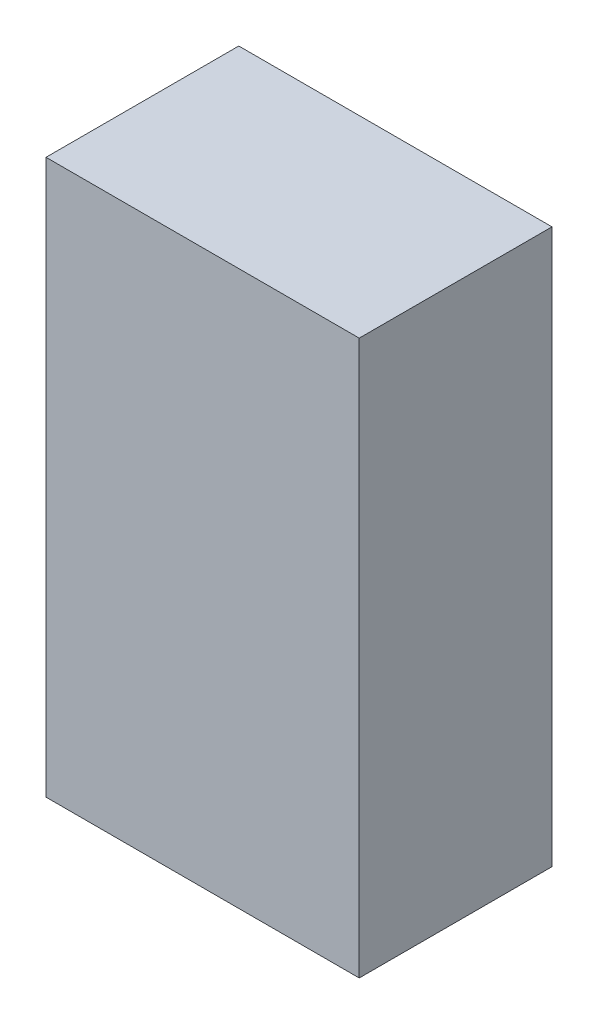
ISO-10303-21;
HEADER;
FILE_DESCRIPTION(('STEP AP214'),'2;1');
FILE_NAME('part.step','',(''),(''),'','','');
FILE_SCHEMA(('AUTOMOTIVE_DESIGN { 1 0 10303 214 1 1 1 1 }'));
ENDSEC;
DATA;
#1=APPLICATION_CONTEXT('core data for automotive mechanical design processes');
#2=APPLICATION_PROTOCOL_DEFINITION('international standard','automotive_design',2000,#1);
#3=PRODUCT_CONTEXT('',#1,'mechanical');
#4=PRODUCT('Part','Part','',(#3));
#5=PRODUCT_RELATED_PRODUCT_CATEGORY('part','',(#4));
#6=PRODUCT_DEFINITION_FORMATION('','',#4);
#7=PRODUCT_DEFINITION_CONTEXT('part definition',#1,'design');
#8=PRODUCT_DEFINITION('design','',#6,#7);
#9=PRODUCT_DEFINITION_SHAPE('','',#8);
#10=(LENGTH_UNIT() NAMED_UNIT(*) SI_UNIT(.MILLI.,.METRE.));
#11=(NAMED_UNIT(*) PLANE_ANGLE_UNIT() SI_UNIT($,.RADIAN.));
#12=(NAMED_UNIT(*) SI_UNIT($,.STERADIAN.) SOLID_ANGLE_UNIT());
#13=UNCERTAINTY_MEASURE_WITH_UNIT(LENGTH_MEASURE(1.E-05),#10,'distance_accuracy_value','');
#14=(GEOMETRIC_REPRESENTATION_CONTEXT(3) GLOBAL_UNCERTAINTY_ASSIGNED_CONTEXT((#13)) GLOBAL_UNIT_ASSIGNED_CONTEXT((#10,
#11,#12)) REPRESENTATION_CONTEXT('',''));
#15=CARTESIAN_POINT('',(0.,0.,0.));
#16=DIRECTION('',(0.,0.,1.));
#17=DIRECTION('',(1.,0.,0.));
#18=AXIS2_PLACEMENT_3D('',#15,#16,#17);
#19=CARTESIAN_POINT('',(1.29999994,-2.30000048,1.59999934));
#20=DIRECTION('',(0.,0.,-1.));
#21=DIRECTION('',(-1.,0.,0.));
#22=AXIS2_PLACEMENT_3D('',#19,#20,#21);
#23=PLANE('',#22);
#24=DIRECTION('',(1.,0.,0.));
#25=VECTOR('',#24,1.);
#26=CARTESIAN_POINT('',(1.29999994,2.30000048,1.59999934));
#27=LINE('',#26,#25);
#28=CARTESIAN_POINT('',(1.29999994,2.30000048,1.59999934));
#29=VERTEX_POINT('',#28);
#30=CARTESIAN_POINT('',(-1.29999994,2.30000048,1.59999934));
#31=VERTEX_POINT('',#30);
#32=EDGE_CURVE('E55',#29,#31,#27,.F.);
#33=ORIENTED_EDGE('',*,*,#32,.T.);
#34=DIRECTION('',(0.,1.,0.));
#35=VECTOR('',#34,1.);
#36=CARTESIAN_POINT('',(-1.29999994,2.30000048,1.59999934));
#37=LINE('',#36,#35);
#38=CARTESIAN_POINT('',(-1.29999994,-2.30000048,1.59999934));
#39=VERTEX_POINT('',#38);
#40=EDGE_CURVE('E57',#31,#39,#37,.F.);
#41=ORIENTED_EDGE('',*,*,#40,.T.);
#42=DIRECTION('',(1.,0.,0.));
#43=VECTOR('',#42,1.);
#44=CARTESIAN_POINT('',(-1.29999994,-2.30000048,1.59999934));
#45=LINE('',#44,#43);
#46=CARTESIAN_POINT('',(1.29999994,-2.30000048,1.59999934));
#47=VERTEX_POINT('',#46);
#48=EDGE_CURVE('E20',#39,#47,#45,.T.);
#49=ORIENTED_EDGE('',*,*,#48,.T.);
#50=DIRECTION('',(0.,1.,0.));
#51=VECTOR('',#50,1.);
#52=CARTESIAN_POINT('',(1.29999994,-2.30000048,1.59999934));
#53=LINE('',#52,#51);
#54=EDGE_CURVE('E80',#47,#29,#53,.T.);
#55=ORIENTED_EDGE('',*,*,#54,.T.);
#56=EDGE_LOOP('',(#33,#41,#49,#55));
#57=FACE_BOUND('',#56,.T.);
#58=ADVANCED_FACE('F17',(#57),#23,.F.);
#59=CARTESIAN_POINT('',(-1.29999994,-2.30000048,0.));
#60=DIRECTION('',(0.,1.,0.));
#61=DIRECTION('',(0.,0.,1.));
#62=AXIS2_PLACEMENT_3D('',#59,#60,#61);
#63=PLANE('',#62);
#64=DIRECTION('',(0.,0.,1.));
#65=VECTOR('',#64,1.);
#66=CARTESIAN_POINT('',(1.29999994,-2.30000048,0.));
#67=LINE('',#66,#65);
#68=CARTESIAN_POINT('',(1.29999994,-2.30000048,0.));
#69=VERTEX_POINT('',#68);
#70=EDGE_CURVE('E68',#69,#47,#67,.T.);
#71=ORIENTED_EDGE('',*,*,#70,.T.);
#72=ORIENTED_EDGE('',*,*,#48,.F.);
#73=DIRECTION('',(0.,0.,-1.));
#74=VECTOR('',#73,1.);
#75=CARTESIAN_POINT('',(-1.29999994,-2.30000048,0.));
#76=LINE('',#75,#74);
#77=CARTESIAN_POINT('',(-1.29999994,-2.30000048,0.));
#78=VERTEX_POINT('',#77);
#79=EDGE_CURVE('E63',#39,#78,#76,.T.);
#80=ORIENTED_EDGE('',*,*,#79,.T.);
#81=DIRECTION('',(-1.,0.,0.));
#82=VECTOR('',#81,1.);
#83=CARTESIAN_POINT('',(1.29999994,-2.30000048,0.));
#84=LINE('',#83,#82);
#85=EDGE_CURVE('E83',#69,#78,#84,.T.);
#86=ORIENTED_EDGE('',*,*,#85,.F.);
#87=EDGE_LOOP('',(#71,#72,#80,#86));
#88=FACE_BOUND('',#87,.T.);
#89=ADVANCED_FACE('F65',(#88),#63,.F.);
#90=CARTESIAN_POINT('',(-1.29999994,2.30000048,0.));
#91=DIRECTION('',(1.,0.,0.));
#92=DIRECTION('',(0.,0.,-1.));
#93=AXIS2_PLACEMENT_3D('',#90,#91,#92);
#94=PLANE('',#93);
#95=ORIENTED_EDGE('',*,*,#79,.F.);
#96=ORIENTED_EDGE('',*,*,#40,.F.);
#97=DIRECTION('',(0.,0.,-1.));
#98=VECTOR('',#97,1.);
#99=CARTESIAN_POINT('',(-1.29999994,2.30000048,0.));
#100=LINE('',#99,#98);
#101=CARTESIAN_POINT('',(-1.29999994,2.30000048,0.));
#102=VERTEX_POINT('',#101);
#103=EDGE_CURVE('E75',#31,#102,#100,.T.);
#104=ORIENTED_EDGE('',*,*,#103,.T.);
#105=DIRECTION('',(0.,1.,0.));
#106=VECTOR('',#105,1.);
#107=CARTESIAN_POINT('',(-1.29999994,-2.30000048,0.));
#108=LINE('',#107,#106);
#109=EDGE_CURVE('E72',#78,#102,#108,.T.);
#110=ORIENTED_EDGE('',*,*,#109,.F.);
#111=EDGE_LOOP('',(#95,#96,#104,#110));
#112=FACE_BOUND('',#111,.T.);
#113=ADVANCED_FACE('F70',(#112),#94,.F.);
#114=CARTESIAN_POINT('',(1.29999994,2.30000048,0.));
#115=DIRECTION('',(0.,-1.,0.));
#116=DIRECTION('',(0.,0.,-1.));
#117=AXIS2_PLACEMENT_3D('',#114,#115,#116);
#118=PLANE('',#117);
#119=ORIENTED_EDGE('',*,*,#103,.F.);
#120=ORIENTED_EDGE('',*,*,#32,.F.);
#121=DIRECTION('',(0.,0.,1.));
#122=VECTOR('',#121,1.);
#123=CARTESIAN_POINT('',(1.29999994,2.30000048,0.));
#124=LINE('',#123,#122);
#125=CARTESIAN_POINT('',(1.29999994,2.30000048,0.));
#126=VERTEX_POINT('',#125);
#127=EDGE_CURVE('E35',#29,#126,#124,.F.);
#128=ORIENTED_EDGE('',*,*,#127,.T.);
#129=DIRECTION('',(-1.,0.,0.));
#130=VECTOR('',#129,1.);
#131=CARTESIAN_POINT('',(1.29999994,2.30000048,0.));
#132=LINE('',#131,#130);
#133=EDGE_CURVE('E26',#102,#126,#132,.F.);
#134=ORIENTED_EDGE('',*,*,#133,.F.);
#135=EDGE_LOOP('',(#119,#120,#128,#134));
#136=FACE_BOUND('',#135,.T.);
#137=ADVANCED_FACE('F89',(#136),#118,.F.);
#138=CARTESIAN_POINT('',(1.29999994,-2.30000048,0.));
#139=DIRECTION('',(-1.,0.,0.));
#140=DIRECTION('',(0.,0.,1.));
#141=AXIS2_PLACEMENT_3D('',#138,#139,#140);
#142=PLANE('',#141);
#143=ORIENTED_EDGE('',*,*,#127,.F.);
#144=ORIENTED_EDGE('',*,*,#54,.F.);
#145=ORIENTED_EDGE('',*,*,#70,.F.);
#146=DIRECTION('',(0.,1.,0.));
#147=VECTOR('',#146,1.);
#148=CARTESIAN_POINT('',(1.29999994,-2.30000048,0.));
#149=LINE('',#148,#147);
#150=EDGE_CURVE('E11',#126,#69,#149,.F.);
#151=ORIENTED_EDGE('',*,*,#150,.F.);
#152=EDGE_LOOP('',(#143,#144,#145,#151));
#153=FACE_BOUND('',#152,.T.);
#154=ADVANCED_FACE('F91',(#153),#142,.F.);
#155=CARTESIAN_POINT('',(1.29999994,-2.30000048,0.));
#156=DIRECTION('',(0.,0.,-1.));
#157=DIRECTION('',(-1.,0.,0.));
#158=AXIS2_PLACEMENT_3D('',#155,#156,#157);
#159=PLANE('',#158);
#160=ORIENTED_EDGE('',*,*,#133,.T.);
#161=ORIENTED_EDGE('',*,*,#150,.T.);
#162=ORIENTED_EDGE('',*,*,#85,.T.);
#163=ORIENTED_EDGE('',*,*,#109,.T.);
#164=EDGE_LOOP('',(#160,#161,#162,#163));
#165=FACE_BOUND('',#164,.T.);
#166=ADVANCED_FACE('F88',(#165),#159,.T.);
#167=CLOSED_SHELL('',(#58,#89,#113,#137,#154,#166));
#168=MANIFOLD_SOLID_BREP('B1',#167);
#169=ADVANCED_BREP_SHAPE_REPRESENTATION('',(#18,#168),#14);
#170=SHAPE_DEFINITION_REPRESENTATION(#9,#169);
ENDSEC;
END-ISO-10303-21;
